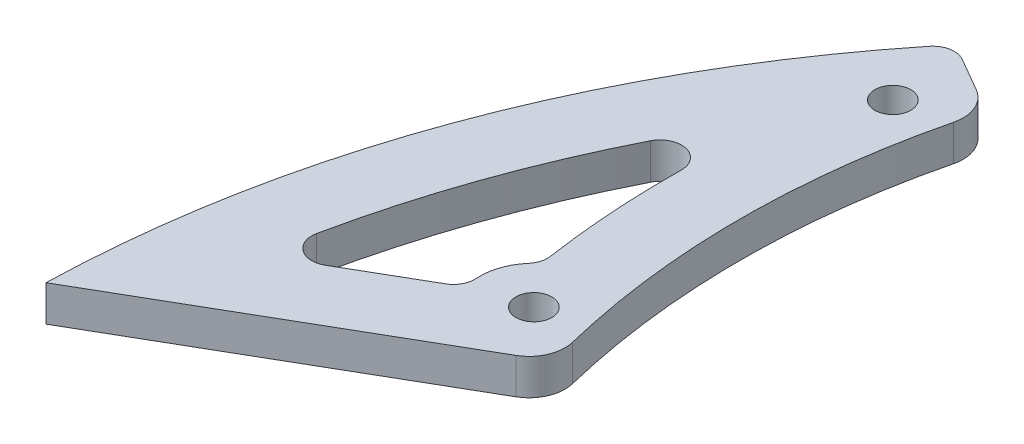
ISO-10303-21;
HEADER;
FILE_DESCRIPTION(('STEP AP214'),'2;1');
FILE_NAME('part.step','',(''),(''),'','','');
FILE_SCHEMA(('AUTOMOTIVE_DESIGN { 1 0 10303 214 1 1 1 1 }'));
ENDSEC;
DATA;
#1=APPLICATION_CONTEXT('core data for automotive mechanical design processes');
#2=APPLICATION_PROTOCOL_DEFINITION('international standard','automotive_design',2000,#1);
#3=PRODUCT_CONTEXT('',#1,'mechanical');
#4=PRODUCT('Part','Part','',(#3));
#5=PRODUCT_RELATED_PRODUCT_CATEGORY('part','',(#4));
#6=PRODUCT_DEFINITION_FORMATION('','',#4);
#7=PRODUCT_DEFINITION_CONTEXT('part definition',#1,'design');
#8=PRODUCT_DEFINITION('design','',#6,#7);
#9=PRODUCT_DEFINITION_SHAPE('','',#8);
#10=(LENGTH_UNIT() NAMED_UNIT(*) SI_UNIT(.MILLI.,.METRE.));
#11=(NAMED_UNIT(*) PLANE_ANGLE_UNIT() SI_UNIT($,.RADIAN.));
#12=(NAMED_UNIT(*) SI_UNIT($,.STERADIAN.) SOLID_ANGLE_UNIT());
#13=UNCERTAINTY_MEASURE_WITH_UNIT(LENGTH_MEASURE(1.E-05),#10,'distance_accuracy_value','');
#14=(GEOMETRIC_REPRESENTATION_CONTEXT(3) GLOBAL_UNCERTAINTY_ASSIGNED_CONTEXT((#13)) GLOBAL_UNIT_ASSIGNED_CONTEXT((#10,
#11,#12)) REPRESENTATION_CONTEXT('',''));
#15=CARTESIAN_POINT('',(0.,0.,0.));
#16=DIRECTION('',(0.,0.,1.));
#17=DIRECTION('',(1.,0.,0.));
#18=AXIS2_PLACEMENT_3D('',#15,#16,#17);
#19=CARTESIAN_POINT('',(0.,2.5,0.));
#20=DIRECTION('',(0.,1.,0.));
#21=DIRECTION('',(0.,0.,1.));
#22=AXIS2_PLACEMENT_3D('',#19,#20,#21);
#23=PLANE('',#22);
#24=DIRECTION('',(-0.866025403784438,0.,-0.500000000000002));
#25=VECTOR('',#24,1.);
#26=CARTESIAN_POINT('',(-13.6770887107073,2.5,23.6894125465716));
#27=LINE('',#26,#25);
#28=CARTESIAN_POINT('',(-110.239570568506,2.5,-32.0609623476472));
#29=VERTEX_POINT('',#28);
#30=CARTESIAN_POINT('',(-114.897907022907,2.5,-34.7504541535714));
#31=VERTEX_POINT('',#30);
#32=EDGE_CURVE('E163',#29,#31,#27,.T.);
#33=ORIENTED_EDGE('',*,*,#32,.T.);
#34=CARTESIAN_POINT('',(-116.397907022907,2.5,-32.152377942218));
#35=DIRECTION('',(0.,1.,0.));
#36=DIRECTION('',(0.,0.,1.));
#37=AXIS2_PLACEMENT_3D('',#34,#35,#36);
#38=CIRCLE('',#37,3.);
#39=CARTESIAN_POINT('',(-118.736688147051,2.5,-34.0312347364802));
#40=VERTEX_POINT('',#39);
#41=EDGE_CURVE('E158',#31,#40,#38,.T.);
#42=ORIENTED_EDGE('',*,*,#41,.T.);
#43=CARTESIAN_POINT('',(-1.79763193982349,2.5,59.9116049766282));
#44=DIRECTION('',(0.,1.,0.));
#45=DIRECTION('',(0.,0.,1.));
#46=AXIS2_PLACEMENT_3D('',#43,#44,#45);
#47=CIRCLE('',#46,150.);
#48=CARTESIAN_POINT('',(-151.747282852686,2.5,56.0254512083643));
#49=VERTEX_POINT('',#48);
#50=EDGE_CURVE('E151',#40,#49,#47,.T.);
#51=ORIENTED_EDGE('',*,*,#50,.T.);
#52=DIRECTION('',(-0.866025403784437,0.,0.500000000000003));
#53=VECTOR('',#52,1.);
#54=CARTESIAN_POINT('',(-13.6770887107073,2.5,-23.6894125465717));
#55=LINE('',#54,#53);
#56=CARTESIAN_POINT('',(-110.239570568506,2.5,32.0609623476471));
#57=VERTEX_POINT('',#56);
#58=EDGE_CURVE('E155',#57,#49,#55,.T.);
#59=ORIENTED_EDGE('',*,*,#58,.F.);
#60=CARTESIAN_POINT('',(-112.739570568506,2.5,27.730835328725));
#61=DIRECTION('',(0.,1.,0.));
#62=DIRECTION('',(0.,0.,1.));
#63=AXIS2_PLACEMENT_3D('',#60,#61,#62);
#64=CIRCLE('',#63,5.);
#65=CARTESIAN_POINT('',(-107.884291904918,2.5,26.5365702413552));
#66=VERTEX_POINT('',#65);
#67=EDGE_CURVE('E210',#57,#66,#64,.T.);
#68=ORIENTED_EDGE('',*,*,#67,.T.);
#69=CARTESIAN_POINT('',(0.,2.5,0.));
#70=DIRECTION('',(0.,1.,0.));
#71=DIRECTION('',(0.,0.,1.));
#72=AXIS2_PLACEMENT_3D('',#69,#70,#71);
#73=CIRCLE('',#72,111.1);
#74=CARTESIAN_POINT('',(-107.884291904918,2.5,-26.5365702413552));
#75=VERTEX_POINT('',#74);
#76=EDGE_CURVE('E467',#75,#66,#73,.T.);
#77=ORIENTED_EDGE('',*,*,#76,.F.);
#78=CARTESIAN_POINT('',(-112.739570568506,2.5,-27.730835328725));
#79=DIRECTION('',(0.,1.,0.));
#80=DIRECTION('',(0.,0.,1.));
#81=AXIS2_PLACEMENT_3D('',#78,#79,#80);
#82=CIRCLE('',#81,5.);
#83=EDGE_CURVE('E208',#75,#29,#82,.T.);
#84=ORIENTED_EDGE('',*,*,#83,.T.);
#85=EDGE_LOOP('',(#33,#42,#51,#59,#68,#77,#84));
#86=FACE_BOUND('',#85,.T.);
#87=CARTESIAN_POINT('',(-114.80962503205,2.5,25.));
#88=DIRECTION('',(0.,1.,0.));
#89=DIRECTION('',(0.,0.,1.));
#90=AXIS2_PLACEMENT_3D('',#87,#88,#89);
#91=CIRCLE('',#90,2.5);
#92=CARTESIAN_POINT('',(-114.80962503205,2.5,27.5));
#93=VERTEX_POINT('',#92);
#94=EDGE_CURVE('E172',#93,#93,#91,.T.);
#95=ORIENTED_EDGE('',*,*,#94,.F.);
#96=EDGE_LOOP('',(#95));
#97=FACE_BOUND('',#96,.T.);
#98=CARTESIAN_POINT('',(-114.80962503205,2.5,-25.));
#99=DIRECTION('',(0.,1.,0.));
#100=DIRECTION('',(0.,0.,1.));
#101=AXIS2_PLACEMENT_3D('',#98,#99,#100);
#102=CIRCLE('',#101,2.5);
#103=CARTESIAN_POINT('',(-114.80962503205,2.5,-22.5));
#104=VERTEX_POINT('',#103);
#105=EDGE_CURVE('E179',#104,#104,#102,.T.);
#106=ORIENTED_EDGE('',*,*,#105,.F.);
#107=EDGE_LOOP('',(#106));
#108=FACE_BOUND('',#107,.T.);
#109=CARTESIAN_POINT('',(-1.79763193982349,2.5,59.9116049766282));
#110=DIRECTION('',(0.,1.,0.));
#111=DIRECTION('',(0.,0.,1.));
#112=AXIS2_PLACEMENT_3D('',#109,#110,#111);
#113=CIRCLE('',#112,140.);
#114=CARTESIAN_POINT('',(-126.764061027961,2.5,-3.20251072627506));
#115=VERTEX_POINT('',#114);
#116=CARTESIAN_POINT('',(-138.83194536498,2.5,31.2480925593424));
#117=VERTEX_POINT('',#116);
#118=EDGE_CURVE('E280',#115,#117,#113,.T.);
#119=ORIENTED_EDGE('',*,*,#118,.F.);
#120=CARTESIAN_POINT('',(-124.086208976072,2.5,-1.85006538978428));
#121=DIRECTION('',(0.,1.,0.));
#122=DIRECTION('',(0.,0.,1.));
#123=AXIS2_PLACEMENT_3D('',#120,#121,#122);
#124=CIRCLE('',#123,3.);
#125=CARTESIAN_POINT('',(-121.086542361018,2.5,-1.80534181065976));
#126=VERTEX_POINT('',#125);
#127=EDGE_CURVE('E241',#115,#126,#124,.F.);
#128=ORIENTED_EDGE('',*,*,#127,.T.);
#129=CARTESIAN_POINT('',(0.,2.5,0.));
#130=DIRECTION('',(0.,1.,0.));
#131=DIRECTION('',(0.,0.,1.));
#132=AXIS2_PLACEMENT_3D('',#129,#130,#131);
#133=CIRCLE('',#132,121.1);
#134=CARTESIAN_POINT('',(-119.798109986119,2.5,17.7093998699513));
#135=VERTEX_POINT('',#134);
#136=EDGE_CURVE('E255',#126,#135,#133,.T.);
#137=ORIENTED_EDGE('',*,*,#136,.T.);
#138=CARTESIAN_POINT('',(-122.765858375535,2.5,18.14811332668));
#139=DIRECTION('',(0.,1.,0.));
#140=DIRECTION('',(0.,0.,1.));
#141=AXIS2_PLACEMENT_3D('',#138,#139,#140);
#142=CIRCLE('',#141,3.);
#143=CARTESIAN_POINT('',(-120.492648848825,2.5,20.1057952333429));
#144=VERTEX_POINT('',#143);
#145=EDGE_CURVE('E51',#135,#144,#142,.F.);
#146=ORIENTED_EDGE('',*,*,#145,.T.);
#147=CARTESIAN_POINT('',(-114.80962503205,2.5,25.));
#148=DIRECTION('',(0.,1.,0.));
#149=DIRECTION('',(0.,0.,1.));
#150=AXIS2_PLACEMENT_3D('',#147,#148,#149);
#151=CIRCLE('',#150,7.5);
#152=CARTESIAN_POINT('',(-122.291194466542,2.5,25.5254700722903));
#153=VERTEX_POINT('',#152);
#154=EDGE_CURVE('E253',#144,#153,#151,.T.);
#155=ORIENTED_EDGE('',*,*,#154,.T.);
#156=CARTESIAN_POINT('',(-125.283822240339,2.5,25.7356581012064));
#157=DIRECTION('',(0.,1.,0.));
#158=DIRECTION('',(0.,0.,1.));
#159=AXIS2_PLACEMENT_3D('',#156,#157,#158);
#160=CIRCLE('',#159,3.);
#161=CARTESIAN_POINT('',(-123.783822240339,2.5,28.3337343125597));
#162=VERTEX_POINT('',#161);
#163=EDGE_CURVE('E58',#153,#162,#160,.F.);
#164=ORIENTED_EDGE('',*,*,#163,.T.);
#165=DIRECTION('',(0.866025403784437,0.,-0.500000000000003));
#166=VECTOR('',#165,1.);
#167=CARTESIAN_POINT('',(-18.6770887107074,2.5,-32.3496665844161));
#168=LINE('',#167,#166);
#169=CARTESIAN_POINT('',(-134.395495791584,2.5,34.4603868939233));
#170=VERTEX_POINT('',#169);
#171=EDGE_CURVE('E287',#170,#162,#168,.T.);
#172=ORIENTED_EDGE('',*,*,#171,.F.);
#173=CARTESIAN_POINT('',(-135.895495791584,2.5,31.86231068257));
#174=DIRECTION('',(0.,1.,0.));
#175=DIRECTION('',(0.,0.,1.));
#176=AXIS2_PLACEMENT_3D('',#173,#174,#175);
#177=CIRCLE('',#176,3.);
#178=EDGE_CURVE('E66',#170,#117,#177,.F.);
#179=ORIENTED_EDGE('',*,*,#178,.T.);
#180=EDGE_LOOP('',(#119,#128,#137,#146,#155,#164,#172,#179));
#181=FACE_BOUND('',#180,.T.);
#182=ADVANCED_FACE('F43',(#86,#97,#108,#181),#23,.T.);
#183=CARTESIAN_POINT('',(0.,-2.5,0.));
#184=DIRECTION('',(0.,1.,0.));
#185=DIRECTION('',(0.,0.,1.));
#186=AXIS2_PLACEMENT_3D('',#183,#184,#185);
#187=PLANE('',#186);
#188=CARTESIAN_POINT('',(-114.80962503205,-2.5,-25.));
#189=DIRECTION('',(0.,1.,0.));
#190=DIRECTION('',(0.,0.,1.));
#191=AXIS2_PLACEMENT_3D('',#188,#189,#190);
#192=CIRCLE('',#191,2.5);
#193=CARTESIAN_POINT('',(-114.80962503205,-2.5,-22.5));
#194=VERTEX_POINT('',#193);
#195=EDGE_CURVE('E187',#194,#194,#192,.T.);
#196=ORIENTED_EDGE('',*,*,#195,.T.);
#197=EDGE_LOOP('',(#196));
#198=FACE_BOUND('',#197,.T.);
#199=CARTESIAN_POINT('',(-114.80962503205,-2.5,25.));
#200=DIRECTION('',(0.,1.,0.));
#201=DIRECTION('',(0.,0.,1.));
#202=AXIS2_PLACEMENT_3D('',#199,#200,#201);
#203=CIRCLE('',#202,2.5);
#204=CARTESIAN_POINT('',(-114.80962503205,-2.5,27.5));
#205=VERTEX_POINT('',#204);
#206=EDGE_CURVE('E484',#205,#205,#203,.T.);
#207=ORIENTED_EDGE('',*,*,#206,.T.);
#208=EDGE_LOOP('',(#207));
#209=FACE_BOUND('',#208,.T.);
#210=CARTESIAN_POINT('',(-1.79763193982349,-2.5,59.9116049766282));
#211=DIRECTION('',(0.,1.,0.));
#212=DIRECTION('',(0.,0.,1.));
#213=AXIS2_PLACEMENT_3D('',#210,#211,#212);
#214=CIRCLE('',#213,150.);
#215=CARTESIAN_POINT('',(-118.736688147051,-2.5,-34.0312347364802));
#216=VERTEX_POINT('',#215);
#217=CARTESIAN_POINT('',(-151.747282852686,-2.5,56.0254512083643));
#218=VERTEX_POINT('',#217);
#219=EDGE_CURVE('E176',#216,#218,#214,.T.);
#220=ORIENTED_EDGE('',*,*,#219,.F.);
#221=CARTESIAN_POINT('',(-116.397907022907,-2.5,-32.152377942218));
#222=DIRECTION('',(0.,1.,0.));
#223=DIRECTION('',(0.,0.,1.));
#224=AXIS2_PLACEMENT_3D('',#221,#222,#223);
#225=CIRCLE('',#224,3.);
#226=CARTESIAN_POINT('',(-114.897907022907,-2.5,-34.7504541535714));
#227=VERTEX_POINT('',#226);
#228=EDGE_CURVE('E227',#216,#227,#225,.F.);
#229=ORIENTED_EDGE('',*,*,#228,.T.);
#230=DIRECTION('',(-0.866025403784438,0.,-0.500000000000002));
#231=VECTOR('',#230,1.);
#232=CARTESIAN_POINT('',(-13.6770887107073,-2.5,23.6894125465716));
#233=LINE('',#232,#231);
#234=CARTESIAN_POINT('',(-110.239570568506,-2.5,-32.0609623476472));
#235=VERTEX_POINT('',#234);
#236=EDGE_CURVE('E480',#235,#227,#233,.T.);
#237=ORIENTED_EDGE('',*,*,#236,.F.);
#238=CARTESIAN_POINT('',(-112.739570568506,-2.5,-27.730835328725));
#239=DIRECTION('',(0.,1.,0.));
#240=DIRECTION('',(0.,0.,1.));
#241=AXIS2_PLACEMENT_3D('',#238,#239,#240);
#242=CIRCLE('',#241,5.);
#243=CARTESIAN_POINT('',(-107.884291904918,-2.5,-26.5365702413552));
#244=VERTEX_POINT('',#243);
#245=EDGE_CURVE('E203',#235,#244,#242,.F.);
#246=ORIENTED_EDGE('',*,*,#245,.T.);
#247=CARTESIAN_POINT('',(0.,-2.5,0.));
#248=DIRECTION('',(0.,1.,0.));
#249=DIRECTION('',(0.,0.,1.));
#250=AXIS2_PLACEMENT_3D('',#247,#248,#249);
#251=CIRCLE('',#250,111.1);
#252=CARTESIAN_POINT('',(-107.884291904918,-2.5,26.5365702413552));
#253=VERTEX_POINT('',#252);
#254=EDGE_CURVE('E477',#244,#253,#251,.T.);
#255=ORIENTED_EDGE('',*,*,#254,.T.);
#256=CARTESIAN_POINT('',(-112.739570568506,-2.5,27.730835328725));
#257=DIRECTION('',(0.,1.,0.));
#258=DIRECTION('',(0.,0.,1.));
#259=AXIS2_PLACEMENT_3D('',#256,#257,#258);
#260=CIRCLE('',#259,5.);
#261=CARTESIAN_POINT('',(-110.239570568506,-2.5,32.0609623476471));
#262=VERTEX_POINT('',#261);
#263=EDGE_CURVE('E205',#253,#262,#260,.F.);
#264=ORIENTED_EDGE('',*,*,#263,.T.);
#265=DIRECTION('',(-0.866025403784437,0.,0.500000000000003));
#266=VECTOR('',#265,1.);
#267=CARTESIAN_POINT('',(-13.6770887107073,-2.5,-23.6894125465717));
#268=LINE('',#267,#266);
#269=EDGE_CURVE('E483',#262,#218,#268,.T.);
#270=ORIENTED_EDGE('',*,*,#269,.T.);
#271=EDGE_LOOP('',(#220,#229,#237,#246,#255,#264,#270));
#272=FACE_BOUND('',#271,.T.);
#273=CARTESIAN_POINT('',(-114.80962503205,-2.5,25.));
#274=DIRECTION('',(0.,1.,0.));
#275=DIRECTION('',(0.,0.,1.));
#276=AXIS2_PLACEMENT_3D('',#273,#274,#275);
#277=CIRCLE('',#276,7.5);
#278=CARTESIAN_POINT('',(-120.492648848825,-2.5,20.1057952333429));
#279=VERTEX_POINT('',#278);
#280=CARTESIAN_POINT('',(-122.291194466542,-2.5,25.5254700722903));
#281=VERTEX_POINT('',#280);
#282=EDGE_CURVE('E195',#279,#281,#277,.T.);
#283=ORIENTED_EDGE('',*,*,#282,.F.);
#284=CARTESIAN_POINT('',(-122.765858375535,-2.5,18.14811332668));
#285=DIRECTION('',(0.,1.,0.));
#286=DIRECTION('',(0.,0.,1.));
#287=AXIS2_PLACEMENT_3D('',#284,#285,#286);
#288=CIRCLE('',#287,3.);
#289=CARTESIAN_POINT('',(-119.798109986119,-2.5,17.7093998699513));
#290=VERTEX_POINT('',#289);
#291=EDGE_CURVE('E11',#279,#290,#288,.T.);
#292=ORIENTED_EDGE('',*,*,#291,.T.);
#293=CARTESIAN_POINT('',(0.,-2.5,0.));
#294=DIRECTION('',(0.,1.,0.));
#295=DIRECTION('',(0.,0.,1.));
#296=AXIS2_PLACEMENT_3D('',#293,#294,#295);
#297=CIRCLE('',#296,121.1);
#298=CARTESIAN_POINT('',(-121.086542361018,-2.5,-1.80534181065976));
#299=VERTEX_POINT('',#298);
#300=EDGE_CURVE('E178',#299,#290,#297,.T.);
#301=ORIENTED_EDGE('',*,*,#300,.F.);
#302=CARTESIAN_POINT('',(-124.086208976072,-2.5,-1.85006538978428));
#303=DIRECTION('',(0.,1.,0.));
#304=DIRECTION('',(0.,0.,1.));
#305=AXIS2_PLACEMENT_3D('',#302,#303,#304);
#306=CIRCLE('',#305,3.);
#307=CARTESIAN_POINT('',(-126.764061027961,-2.5,-3.20251072627506));
#308=VERTEX_POINT('',#307);
#309=EDGE_CURVE('E243',#299,#308,#306,.T.);
#310=ORIENTED_EDGE('',*,*,#309,.T.);
#311=CARTESIAN_POINT('',(-1.79763193982349,-2.5,59.9116049766282));
#312=DIRECTION('',(0.,1.,0.));
#313=DIRECTION('',(0.,0.,1.));
#314=AXIS2_PLACEMENT_3D('',#311,#312,#313);
#315=CIRCLE('',#314,140.);
#316=CARTESIAN_POINT('',(-138.83194536498,-2.5,31.2480925593424));
#317=VERTEX_POINT('',#316);
#318=EDGE_CURVE('E182',#308,#317,#315,.T.);
#319=ORIENTED_EDGE('',*,*,#318,.T.);
#320=CARTESIAN_POINT('',(-135.895495791584,-2.5,31.86231068257));
#321=DIRECTION('',(0.,1.,0.));
#322=DIRECTION('',(0.,0.,1.));
#323=AXIS2_PLACEMENT_3D('',#320,#321,#322);
#324=CIRCLE('',#323,3.);
#325=CARTESIAN_POINT('',(-134.395495791584,-2.5,34.4603868939233));
#326=VERTEX_POINT('',#325);
#327=EDGE_CURVE('E249',#317,#326,#324,.T.);
#328=ORIENTED_EDGE('',*,*,#327,.T.);
#329=DIRECTION('',(0.866025403784437,0.,-0.500000000000003));
#330=VECTOR('',#329,1.);
#331=CARTESIAN_POINT('',(-18.6770887107074,-2.5,-32.3496665844161));
#332=LINE('',#331,#330);
#333=CARTESIAN_POINT('',(-123.783822240339,-2.5,28.3337343125597));
#334=VERTEX_POINT('',#333);
#335=EDGE_CURVE('E192',#326,#334,#332,.T.);
#336=ORIENTED_EDGE('',*,*,#335,.T.);
#337=CARTESIAN_POINT('',(-125.283822240339,-2.5,25.7356581012064));
#338=DIRECTION('',(0.,1.,0.));
#339=DIRECTION('',(0.,0.,1.));
#340=AXIS2_PLACEMENT_3D('',#337,#338,#339);
#341=CIRCLE('',#340,3.);
#342=EDGE_CURVE('E246',#334,#281,#341,.T.);
#343=ORIENTED_EDGE('',*,*,#342,.T.);
#344=EDGE_LOOP('',(#283,#292,#301,#310,#319,#328,#336,#343));
#345=FACE_BOUND('',#344,.T.);
#346=ADVANCED_FACE('F267',(#198,#209,#272,#345),#187,.F.);
#347=CARTESIAN_POINT('',(0.,2.5,0.));
#348=DIRECTION('',(0.,-1.,0.));
#349=DIRECTION('',(0.,0.,-1.));
#350=AXIS2_PLACEMENT_3D('',#347,#348,#349);
#351=CYLINDRICAL_SURFACE('',#350,111.1);
#352=ORIENTED_EDGE('',*,*,#76,.T.);
#353=DIRECTION('',(0.,-1.,0.));
#354=VECTOR('',#353,1.);
#355=CARTESIAN_POINT('',(-107.884291904918,2.5,26.5365702413552));
#356=LINE('',#355,#354);
#357=EDGE_CURVE('E200',#66,#253,#356,.T.);
#358=ORIENTED_EDGE('',*,*,#357,.T.);
#359=ORIENTED_EDGE('',*,*,#254,.F.);
#360=DIRECTION('',(0.,-1.,0.));
#361=VECTOR('',#360,1.);
#362=CARTESIAN_POINT('',(-107.884291904918,2.5,-26.5365702413552));
#363=LINE('',#362,#361);
#364=EDGE_CURVE('E198',#244,#75,#363,.F.);
#365=ORIENTED_EDGE('',*,*,#364,.T.);
#366=EDGE_LOOP('',(#352,#358,#359,#365));
#367=FACE_BOUND('',#366,.T.);
#368=ADVANCED_FACE('F306',(#367),#351,.F.);
#369=CARTESIAN_POINT('',(-13.6770887107073,2.5,23.6894125465716));
#370=DIRECTION('',(-0.500000000000002,0.,0.866025403784438));
#371=DIRECTION('',(0.866025403784438,0.,0.500000000000002));
#372=AXIS2_PLACEMENT_3D('',#369,#370,#371);
#373=PLANE('',#372);
#374=ORIENTED_EDGE('',*,*,#236,.T.);
#375=DIRECTION('',(0.,-1.,0.));
#376=VECTOR('',#375,1.);
#377=CARTESIAN_POINT('',(-114.897907022907,2.5,-34.7504541535713));
#378=LINE('',#377,#376);
#379=EDGE_CURVE('E229',#227,#31,#378,.F.);
#380=ORIENTED_EDGE('',*,*,#379,.T.);
#381=ORIENTED_EDGE('',*,*,#32,.F.);
#382=DIRECTION('',(0.,1.,0.));
#383=VECTOR('',#382,1.);
#384=CARTESIAN_POINT('',(-110.239570568506,-2.5,-32.0609623476471));
#385=LINE('',#384,#383);
#386=EDGE_CURVE('E212',#29,#235,#385,.F.);
#387=ORIENTED_EDGE('',*,*,#386,.T.);
#388=EDGE_LOOP('',(#374,#380,#381,#387));
#389=FACE_BOUND('',#388,.T.);
#390=ADVANCED_FACE('F324',(#389),#373,.F.);
#391=CARTESIAN_POINT('',(-1.79763193982349,2.5,59.9116049766282));
#392=DIRECTION('',(0.,-1.,0.));
#393=DIRECTION('',(0.,0.,-1.));
#394=AXIS2_PLACEMENT_3D('',#391,#392,#393);
#395=CYLINDRICAL_SURFACE('',#394,150.);
#396=ORIENTED_EDGE('',*,*,#50,.F.);
#397=DIRECTION('',(0.,-1.,0.));
#398=VECTOR('',#397,1.);
#399=CARTESIAN_POINT('',(-118.736688147051,2.5,-34.0312347364802));
#400=LINE('',#399,#398);
#401=EDGE_CURVE('E225',#40,#216,#400,.T.);
#402=ORIENTED_EDGE('',*,*,#401,.T.);
#403=ORIENTED_EDGE('',*,*,#219,.T.);
#404=DIRECTION('',(0.,-1.,0.));
#405=VECTOR('',#404,1.);
#406=CARTESIAN_POINT('',(-151.747282852686,2.5,56.0254512083643));
#407=LINE('',#406,#405);
#408=EDGE_CURVE('E169',#49,#218,#407,.T.);
#409=ORIENTED_EDGE('',*,*,#408,.F.);
#410=EDGE_LOOP('',(#396,#402,#403,#409));
#411=FACE_BOUND('',#410,.T.);
#412=ADVANCED_FACE('F174',(#411),#395,.T.);
#413=CARTESIAN_POINT('',(-114.80962503205,2.5,25.));
#414=DIRECTION('',(0.,-1.,0.));
#415=DIRECTION('',(0.,0.,-1.));
#416=AXIS2_PLACEMENT_3D('',#413,#414,#415);
#417=CYLINDRICAL_SURFACE('',#416,2.5);
#418=ORIENTED_EDGE('',*,*,#94,.T.);
#419=EDGE_LOOP('',(#418));
#420=FACE_BOUND('',#419,.T.);
#421=ORIENTED_EDGE('',*,*,#206,.F.);
#422=EDGE_LOOP('',(#421));
#423=FACE_BOUND('',#422,.T.);
#424=ADVANCED_FACE('F316',(#420,#423),#417,.F.);
#425=CARTESIAN_POINT('',(-13.6770887107073,2.5,-23.6894125465717));
#426=DIRECTION('',(0.500000000000003,0.,0.866025403784437));
#427=DIRECTION('',(0.866025403784437,0.,-0.500000000000003));
#428=AXIS2_PLACEMENT_3D('',#425,#426,#427);
#429=PLANE('',#428);
#430=ORIENTED_EDGE('',*,*,#269,.F.);
#431=DIRECTION('',(0.,-1.,0.));
#432=VECTOR('',#431,1.);
#433=CARTESIAN_POINT('',(-110.239570568506,2.5,32.0609623476471));
#434=LINE('',#433,#432);
#435=EDGE_CURVE('E171',#262,#57,#434,.F.);
#436=ORIENTED_EDGE('',*,*,#435,.T.);
#437=ORIENTED_EDGE('',*,*,#58,.T.);
#438=ORIENTED_EDGE('',*,*,#408,.T.);
#439=EDGE_LOOP('',(#430,#436,#437,#438));
#440=FACE_BOUND('',#439,.T.);
#441=ADVANCED_FACE('F168',(#440),#429,.T.);
#442=CARTESIAN_POINT('',(-114.80962503205,2.5,-25.));
#443=DIRECTION('',(0.,-1.,0.));
#444=DIRECTION('',(0.,0.,-1.));
#445=AXIS2_PLACEMENT_3D('',#442,#443,#444);
#446=CYLINDRICAL_SURFACE('',#445,2.5);
#447=ORIENTED_EDGE('',*,*,#105,.T.);
#448=EDGE_LOOP('',(#447));
#449=FACE_BOUND('',#448,.T.);
#450=ORIENTED_EDGE('',*,*,#195,.F.);
#451=EDGE_LOOP('',(#450));
#452=FACE_BOUND('',#451,.T.);
#453=ADVANCED_FACE('F312',(#449,#452),#446,.F.);
#454=CARTESIAN_POINT('',(-114.80962503205,-17.6844362259733,25.));
#455=DIRECTION('',(0.,1.,0.));
#456=DIRECTION('',(0.,0.,1.));
#457=AXIS2_PLACEMENT_3D('',#454,#455,#456);
#458=CYLINDRICAL_SURFACE('',#457,7.5);
#459=ORIENTED_EDGE('',*,*,#282,.T.);
#460=DIRECTION('',(0.,1.,0.));
#461=VECTOR('',#460,1.);
#462=CARTESIAN_POINT('',(-122.291194466542,-17.6844362259733,25.5254700722903));
#463=LINE('',#462,#461);
#464=EDGE_CURVE('E234',#281,#153,#463,.T.);
#465=ORIENTED_EDGE('',*,*,#464,.T.);
#466=ORIENTED_EDGE('',*,*,#154,.F.);
#467=DIRECTION('',(0.,1.,0.));
#468=VECTOR('',#467,1.);
#469=CARTESIAN_POINT('',(-120.492648848825,-17.6844362259733,20.1057952333429));
#470=LINE('',#469,#468);
#471=EDGE_CURVE('E232',#144,#279,#470,.F.);
#472=ORIENTED_EDGE('',*,*,#471,.T.);
#473=EDGE_LOOP('',(#459,#465,#466,#472));
#474=FACE_BOUND('',#473,.T.);
#475=ADVANCED_FACE('F260',(#474),#458,.T.);
#476=CARTESIAN_POINT('',(-18.6770887107074,-17.6844362259733,-32.3496665844161));
#477=DIRECTION('',(0.500000000000003,0.,0.866025403784437));
#478=DIRECTION('',(0.866025403784437,0.,-0.500000000000003));
#479=AXIS2_PLACEMENT_3D('',#476,#477,#478);
#480=PLANE('',#479);
#481=ORIENTED_EDGE('',*,*,#171,.T.);
#482=DIRECTION('',(0.,1.,0.));
#483=VECTOR('',#482,1.);
#484=CARTESIAN_POINT('',(-123.783822240339,-17.6844362259733,28.3337343125597));
#485=LINE('',#484,#483);
#486=EDGE_CURVE('E239',#162,#334,#485,.F.);
#487=ORIENTED_EDGE('',*,*,#486,.T.);
#488=ORIENTED_EDGE('',*,*,#335,.F.);
#489=DIRECTION('',(0.,-1.,0.));
#490=VECTOR('',#489,1.);
#491=CARTESIAN_POINT('',(-134.395495791584,2.5,34.4603868939233));
#492=LINE('',#491,#490);
#493=EDGE_CURVE('E237',#326,#170,#492,.F.);
#494=ORIENTED_EDGE('',*,*,#493,.T.);
#495=EDGE_LOOP('',(#481,#487,#488,#494));
#496=FACE_BOUND('',#495,.T.);
#497=ADVANCED_FACE('F285',(#496),#480,.F.);
#498=CARTESIAN_POINT('',(-1.79763193982349,-17.6844362259733,59.9116049766282));
#499=DIRECTION('',(0.,1.,0.));
#500=DIRECTION('',(0.,0.,1.));
#501=AXIS2_PLACEMENT_3D('',#498,#499,#500);
#502=CYLINDRICAL_SURFACE('',#501,140.);
#503=ORIENTED_EDGE('',*,*,#318,.F.);
#504=DIRECTION('',(0.,1.,0.));
#505=VECTOR('',#504,1.);
#506=CARTESIAN_POINT('',(-126.764061027961,-17.6844362259733,-3.20251072627507));
#507=LINE('',#506,#505);
#508=EDGE_CURVE('E217',#308,#115,#507,.T.);
#509=ORIENTED_EDGE('',*,*,#508,.T.);
#510=ORIENTED_EDGE('',*,*,#118,.T.);
#511=DIRECTION('',(0.,1.,0.));
#512=VECTOR('',#511,1.);
#513=CARTESIAN_POINT('',(-138.83194536498,-17.6844362259733,31.2480925593424));
#514=LINE('',#513,#512);
#515=EDGE_CURVE('E215',#117,#317,#514,.F.);
#516=ORIENTED_EDGE('',*,*,#515,.T.);
#517=EDGE_LOOP('',(#503,#509,#510,#516));
#518=FACE_BOUND('',#517,.T.);
#519=ADVANCED_FACE('F278',(#518),#502,.F.);
#520=CARTESIAN_POINT('',(0.,-17.6844362259733,0.));
#521=DIRECTION('',(0.,1.,0.));
#522=DIRECTION('',(0.,0.,1.));
#523=AXIS2_PLACEMENT_3D('',#520,#521,#522);
#524=CYLINDRICAL_SURFACE('',#523,121.1);
#525=ORIENTED_EDGE('',*,*,#136,.F.);
#526=DIRECTION('',(0.,1.,0.));
#527=VECTOR('',#526,1.);
#528=CARTESIAN_POINT('',(-121.086542361018,-17.6844362259733,-1.80534181065976));
#529=LINE('',#528,#527);
#530=EDGE_CURVE('E223',#126,#299,#529,.F.);
#531=ORIENTED_EDGE('',*,*,#530,.T.);
#532=ORIENTED_EDGE('',*,*,#300,.T.);
#533=DIRECTION('',(0.,1.,0.));
#534=VECTOR('',#533,1.);
#535=CARTESIAN_POINT('',(-119.798109986119,-17.6844362259733,17.7093998699513));
#536=LINE('',#535,#534);
#537=EDGE_CURVE('E220',#290,#135,#536,.T.);
#538=ORIENTED_EDGE('',*,*,#537,.T.);
#539=EDGE_LOOP('',(#525,#531,#532,#538));
#540=FACE_BOUND('',#539,.T.);
#541=ADVANCED_FACE('F270',(#540),#524,.T.);
#542=CARTESIAN_POINT('',(-112.739570568506,2.5,27.730835328725));
#543=DIRECTION('',(0.,-1.,0.));
#544=DIRECTION('',(0.,0.,-1.));
#545=AXIS2_PLACEMENT_3D('',#542,#543,#544);
#546=CYLINDRICAL_SURFACE('',#545,5.);
#547=ORIENTED_EDGE('',*,*,#67,.F.);
#548=ORIENTED_EDGE('',*,*,#435,.F.);
#549=ORIENTED_EDGE('',*,*,#263,.F.);
#550=ORIENTED_EDGE('',*,*,#357,.F.);
#551=EDGE_LOOP('',(#547,#548,#549,#550));
#552=FACE_BOUND('',#551,.T.);
#553=ADVANCED_FACE('F331',(#552),#546,.T.);
#554=CARTESIAN_POINT('',(-112.739570568506,2.5,-27.730835328725));
#555=DIRECTION('',(0.,-1.,0.));
#556=DIRECTION('',(0.,0.,-1.));
#557=AXIS2_PLACEMENT_3D('',#554,#555,#556);
#558=CYLINDRICAL_SURFACE('',#557,5.);
#559=ORIENTED_EDGE('',*,*,#83,.F.);
#560=ORIENTED_EDGE('',*,*,#364,.F.);
#561=ORIENTED_EDGE('',*,*,#245,.F.);
#562=ORIENTED_EDGE('',*,*,#386,.F.);
#563=EDGE_LOOP('',(#559,#560,#561,#562));
#564=FACE_BOUND('',#563,.T.);
#565=ADVANCED_FACE('F334',(#564),#558,.T.);
#566=CARTESIAN_POINT('',(-124.086208976072,-17.6844362259733,-1.85006538978428));
#567=DIRECTION('',(0.,1.,0.));
#568=DIRECTION('',(0.,0.,1.));
#569=AXIS2_PLACEMENT_3D('',#566,#567,#568);
#570=CYLINDRICAL_SURFACE('',#569,3.);
#571=ORIENTED_EDGE('',*,*,#309,.F.);
#572=ORIENTED_EDGE('',*,*,#530,.F.);
#573=ORIENTED_EDGE('',*,*,#127,.F.);
#574=ORIENTED_EDGE('',*,*,#508,.F.);
#575=EDGE_LOOP('',(#571,#572,#573,#574));
#576=FACE_BOUND('',#575,.T.);
#577=ADVANCED_FACE('F273',(#576),#570,.F.);
#578=CARTESIAN_POINT('',(-116.397907022907,2.5,-32.152377942218));
#579=DIRECTION('',(0.,-1.,0.));
#580=DIRECTION('',(0.,0.,-1.));
#581=AXIS2_PLACEMENT_3D('',#578,#579,#580);
#582=CYLINDRICAL_SURFACE('',#581,3.);
#583=ORIENTED_EDGE('',*,*,#41,.F.);
#584=ORIENTED_EDGE('',*,*,#379,.F.);
#585=ORIENTED_EDGE('',*,*,#228,.F.);
#586=ORIENTED_EDGE('',*,*,#401,.F.);
#587=EDGE_LOOP('',(#583,#584,#585,#586));
#588=FACE_BOUND('',#587,.T.);
#589=ADVANCED_FACE('F291',(#588),#582,.T.);
#590=CARTESIAN_POINT('',(-125.283822240339,-17.6844362259733,25.7356581012064));
#591=DIRECTION('',(0.,1.,0.));
#592=DIRECTION('',(0.,0.,1.));
#593=AXIS2_PLACEMENT_3D('',#590,#591,#592);
#594=CYLINDRICAL_SURFACE('',#593,3.);
#595=ORIENTED_EDGE('',*,*,#342,.F.);
#596=ORIENTED_EDGE('',*,*,#486,.F.);
#597=ORIENTED_EDGE('',*,*,#163,.F.);
#598=ORIENTED_EDGE('',*,*,#464,.F.);
#599=EDGE_LOOP('',(#595,#596,#597,#598));
#600=FACE_BOUND('',#599,.T.);
#601=ADVANCED_FACE('F289',(#600),#594,.F.);
#602=CARTESIAN_POINT('',(-135.895495791584,-17.6844362259733,31.86231068257));
#603=DIRECTION('',(0.,1.,0.));
#604=DIRECTION('',(0.,0.,1.));
#605=AXIS2_PLACEMENT_3D('',#602,#603,#604);
#606=CYLINDRICAL_SURFACE('',#605,3.);
#607=ORIENTED_EDGE('',*,*,#327,.F.);
#608=ORIENTED_EDGE('',*,*,#515,.F.);
#609=ORIENTED_EDGE('',*,*,#178,.F.);
#610=ORIENTED_EDGE('',*,*,#493,.F.);
#611=EDGE_LOOP('',(#607,#608,#609,#610));
#612=FACE_BOUND('',#611,.T.);
#613=ADVANCED_FACE('F281',(#612),#606,.F.);
#614=CARTESIAN_POINT('',(-122.765858375535,-17.6844362259733,18.14811332668));
#615=DIRECTION('',(0.,-1.,0.));
#616=DIRECTION('',(0.,0.,-1.));
#617=AXIS2_PLACEMENT_3D('',#614,#615,#616);
#618=CYLINDRICAL_SURFACE('',#617,3.);
#619=ORIENTED_EDGE('',*,*,#291,.F.);
#620=ORIENTED_EDGE('',*,*,#471,.F.);
#621=ORIENTED_EDGE('',*,*,#145,.F.);
#622=ORIENTED_EDGE('',*,*,#537,.F.);
#623=EDGE_LOOP('',(#619,#620,#621,#622));
#624=FACE_BOUND('',#623,.T.);
#625=ADVANCED_FACE('F45',(#624),#618,.F.);
#626=CLOSED_SHELL('',(#182,#346,#368,#390,#412,#424,#441,#453,#475,#497,#519,#541,#553,#565,
#577,#589,#601,#613,#625));
#627=MANIFOLD_SOLID_BREP('B2',#626);
#628=ADVANCED_BREP_SHAPE_REPRESENTATION('',(#18,#627),#14);
#629=SHAPE_DEFINITION_REPRESENTATION(#9,#628);
ENDSEC;
END-ISO-10303-21;
